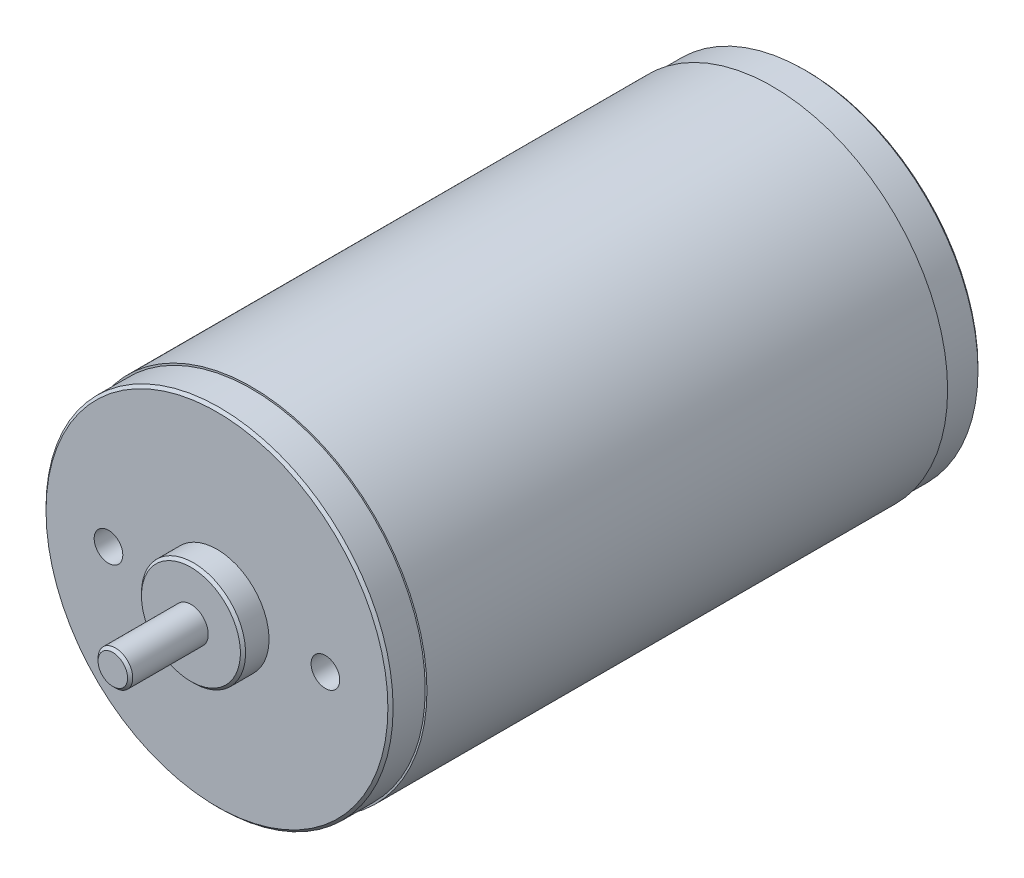
ISO-10303-21;
HEADER;
FILE_DESCRIPTION(('STEP AP214'),'2;1');
FILE_NAME('part.step','',(''),(''),'','','');
FILE_SCHEMA(('AUTOMOTIVE_DESIGN { 1 0 10303 214 1 1 1 1 }'));
ENDSEC;
DATA;
#1=APPLICATION_CONTEXT('core data for automotive mechanical design processes');
#2=APPLICATION_PROTOCOL_DEFINITION('international standard','automotive_design',2000,#1);
#3=PRODUCT_CONTEXT('',#1,'mechanical');
#4=PRODUCT('Part','Part','',(#3));
#5=PRODUCT_RELATED_PRODUCT_CATEGORY('part','',(#4));
#6=PRODUCT_DEFINITION_FORMATION('','',#4);
#7=PRODUCT_DEFINITION_CONTEXT('part definition',#1,'design');
#8=PRODUCT_DEFINITION('design','',#6,#7);
#9=PRODUCT_DEFINITION_SHAPE('','',#8);
#10=(LENGTH_UNIT() NAMED_UNIT(*) SI_UNIT(.MILLI.,.METRE.));
#11=(NAMED_UNIT(*) PLANE_ANGLE_UNIT() SI_UNIT($,.RADIAN.));
#12=(NAMED_UNIT(*) SI_UNIT($,.STERADIAN.) SOLID_ANGLE_UNIT());
#13=UNCERTAINTY_MEASURE_WITH_UNIT(LENGTH_MEASURE(1.E-05),#10,'distance_accuracy_value','');
#14=(GEOMETRIC_REPRESENTATION_CONTEXT(3) GLOBAL_UNCERTAINTY_ASSIGNED_CONTEXT((#13)) GLOBAL_UNIT_ASSIGNED_CONTEXT((#10,
#11,#12)) REPRESENTATION_CONTEXT('',''));
#15=CARTESIAN_POINT('',(0.,0.,0.));
#16=DIRECTION('',(0.,0.,1.));
#17=DIRECTION('',(1.,0.,0.));
#18=AXIS2_PLACEMENT_3D('',#15,#16,#17);
#19=CARTESIAN_POINT('',(0.,0.,12.));
#20=DIRECTION('',(0.,0.,1.));
#21=DIRECTION('',(1.,0.,0.));
#22=AXIS2_PLACEMENT_3D('',#19,#20,#21);
#23=PLANE('',#22);
#24=CARTESIAN_POINT('',(0.,0.,12.0000000000573));
#25=DIRECTION('',(0.,0.,-1.));
#26=DIRECTION('',(-1.,0.,0.));
#27=AXIS2_PLACEMENT_3D('',#24,#25,#26);
#28=CIRCLE('',#27,1.70000000002801);
#29=CARTESIAN_POINT('',(-1.70000000002801,0.,12.0000000000573));
#30=VERTEX_POINT('',#29);
#31=EDGE_CURVE('E19',#30,#30,#28,.T.);
#32=ORIENTED_EDGE('',*,*,#31,.F.);
#33=EDGE_LOOP('',(#32));
#34=FACE_BOUND('',#33,.T.);
#35=ADVANCED_FACE('F16',(#34),#23,.T.);
#36=CARTESIAN_POINT('',(0.,0.,11.7000000000758));
#37=DIRECTION('',(0.,0.,-1.));
#38=DIRECTION('',(-1.,0.,0.));
#39=AXIS2_PLACEMENT_3D('',#36,#37,#38);
#40=CONICAL_SURFACE('',#39,2.00000000000955,0.785398163397448);
#41=CARTESIAN_POINT('',(0.,0.,11.7));
#42=DIRECTION('',(0.,0.,-1.));
#43=DIRECTION('',(-1.,0.,0.));
#44=AXIS2_PLACEMENT_3D('',#41,#42,#43);
#45=CIRCLE('',#44,2.);
#46=CARTESIAN_POINT('',(-2.,0.,11.7));
#47=VERTEX_POINT('',#46);
#48=EDGE_CURVE('E61',#47,#47,#45,.T.);
#49=ORIENTED_EDGE('',*,*,#48,.F.);
#50=EDGE_LOOP('',(#49));
#51=FACE_BOUND('',#50,.T.);
#52=ORIENTED_EDGE('',*,*,#31,.T.);
#53=EDGE_LOOP('',(#52));
#54=FACE_BOUND('',#53,.T.);
#55=ADVANCED_FACE('F119',(#51,#54),#40,.T.);
#56=CARTESIAN_POINT('',(0.,0.,12.));
#57=DIRECTION('',(0.,0.,-1.));
#58=DIRECTION('',(-1.,0.,0.));
#59=AXIS2_PLACEMENT_3D('',#56,#57,#58);
#60=CYLINDRICAL_SURFACE('',#59,2.);
#61=CARTESIAN_POINT('',(0.,0.,3.));
#62=DIRECTION('',(0.,0.,-1.));
#63=DIRECTION('',(-1.,0.,0.));
#64=AXIS2_PLACEMENT_3D('',#61,#62,#63);
#65=CIRCLE('',#64,2.);
#66=CARTESIAN_POINT('',(-2.,0.,3.));
#67=VERTEX_POINT('',#66);
#68=EDGE_CURVE('E64',#67,#67,#65,.T.);
#69=ORIENTED_EDGE('',*,*,#68,.F.);
#70=EDGE_LOOP('',(#69));
#71=FACE_BOUND('',#70,.T.);
#72=ORIENTED_EDGE('',*,*,#48,.T.);
#73=EDGE_LOOP('',(#72));
#74=FACE_BOUND('',#73,.T.);
#75=ADVANCED_FACE('F115',(#71,#74),#60,.T.);
#76=CARTESIAN_POINT('',(0.,0.,-69.5));
#77=DIRECTION('',(0.,0.,-1.));
#78=DIRECTION('',(-1.,0.,0.));
#79=AXIS2_PLACEMENT_3D('',#76,#77,#78);
#80=PLANE('',#79);
#81=CARTESIAN_POINT('',(0.,0.,-69.5000000000618));
#82=DIRECTION('',(0.,0.,1.));
#83=DIRECTION('',(1.,0.,0.));
#84=AXIS2_PLACEMENT_3D('',#81,#82,#83);
#85=CIRCLE('',#84,6.02500000002237);
#86=CARTESIAN_POINT('',(6.02500000002237,0.,-69.5000000000618));
#87=VERTEX_POINT('',#86);
#88=EDGE_CURVE('E105',#87,#87,#85,.T.);
#89=ORIENTED_EDGE('',*,*,#88,.F.);
#90=EDGE_LOOP('',(#89));
#91=FACE_BOUND('',#90,.T.);
#92=ADVANCED_FACE('F118',(#91),#80,.T.);
#93=CARTESIAN_POINT('',(0.,0.,3.));
#94=DIRECTION('',(0.,0.,1.));
#95=DIRECTION('',(1.,0.,0.));
#96=AXIS2_PLACEMENT_3D('',#93,#94,#95);
#97=PLANE('',#96);
#98=ORIENTED_EDGE('',*,*,#68,.T.);
#99=EDGE_LOOP('',(#98));
#100=FACE_BOUND('',#99,.T.);
#101=CARTESIAN_POINT('',(0.,0.,2.9999999999859));
#102=DIRECTION('',(0.,0.,-1.));
#103=DIRECTION('',(-1.,0.,0.));
#104=AXIS2_PLACEMENT_3D('',#101,#102,#103);
#105=CIRCLE('',#104,5.70000000004711);
#106=CARTESIAN_POINT('',(-5.70000000004711,0.,2.9999999999859));
#107=VERTEX_POINT('',#106);
#108=EDGE_CURVE('E57',#107,#107,#105,.T.);
#109=ORIENTED_EDGE('',*,*,#108,.F.);
#110=EDGE_LOOP('',(#109));
#111=FACE_BOUND('',#110,.T.);
#112=ADVANCED_FACE('F112',(#100,#111),#97,.T.);
#113=CARTESIAN_POINT('',(0.,0.,-69.2000000000803));
#114=DIRECTION('',(0.,0.,1.));
#115=DIRECTION('',(1.,0.,0.));
#116=AXIS2_PLACEMENT_3D('',#113,#114,#115);
#117=CONICAL_SURFACE('',#116,6.32500000000391,0.785398163397448);
#118=ORIENTED_EDGE('',*,*,#88,.T.);
#119=EDGE_LOOP('',(#118));
#120=FACE_BOUND('',#119,.T.);
#121=CARTESIAN_POINT('',(0.,0.,-69.2));
#122=DIRECTION('',(0.,0.,1.));
#123=DIRECTION('',(1.,0.,0.));
#124=AXIS2_PLACEMENT_3D('',#121,#122,#123);
#125=CIRCLE('',#124,6.325);
#126=CARTESIAN_POINT('',(6.325,0.,-69.2));
#127=VERTEX_POINT('',#126);
#128=EDGE_CURVE('E47',#127,#127,#125,.T.);
#129=ORIENTED_EDGE('',*,*,#128,.F.);
#130=EDGE_LOOP('',(#129));
#131=FACE_BOUND('',#130,.T.);
#132=ADVANCED_FACE('F39',(#120,#131),#117,.T.);
#133=CARTESIAN_POINT('',(-12.5,0.,-8.10000000012678));
#134=DIRECTION('',(0.,0.,1.));
#135=DIRECTION('',(1.,0.,0.));
#136=AXIS2_PLACEMENT_3D('',#133,#134,#135);
#137=CONICAL_SURFACE('',#136,1.6499999998814,1.02974425849465);
#138=CARTESIAN_POINT('',(-12.5000000002728,0.,-9.09142002154795));
#139=VERTEX_POINT('',#138);
#140=VERTEX_LOOP('',#139);
#141=FACE_BOUND('',#140,.T.);
#142=CARTESIAN_POINT('',(-12.5,0.,-8.1));
#143=DIRECTION('',(0.,0.,1.));
#144=DIRECTION('',(1.,0.,0.));
#145=AXIS2_PLACEMENT_3D('',#142,#143,#144);
#146=CIRCLE('',#145,1.65);
#147=CARTESIAN_POINT('',(-10.85,0.,-8.1));
#148=VERTEX_POINT('',#147);
#149=EDGE_CURVE('E43',#148,#148,#146,.T.);
#150=ORIENTED_EDGE('',*,*,#149,.T.);
#151=EDGE_LOOP('',(#150));
#152=FACE_BOUND('',#151,.T.);
#153=ADVANCED_FACE('F35',(#141,#152),#137,.F.);
#154=CARTESIAN_POINT('',(12.5,0.,-8.10000000012678));
#155=DIRECTION('',(0.,0.,1.));
#156=DIRECTION('',(1.,0.,0.));
#157=AXIS2_PLACEMENT_3D('',#154,#155,#156);
#158=CONICAL_SURFACE('',#157,1.64999999985866,1.02974425848248);
#159=CARTESIAN_POINT('',(12.4999999997328,0.,-9.09142002157637));
#160=VERTEX_POINT('',#159);
#161=VERTEX_LOOP('',#160);
#162=FACE_BOUND('',#161,.T.);
#163=CARTESIAN_POINT('',(12.5,0.,-8.1));
#164=DIRECTION('',(0.,0.,1.));
#165=DIRECTION('',(1.,0.,0.));
#166=AXIS2_PLACEMENT_3D('',#163,#164,#165);
#167=CIRCLE('',#166,1.65);
#168=CARTESIAN_POINT('',(14.15,0.,-8.1));
#169=VERTEX_POINT('',#168);
#170=EDGE_CURVE('E46',#169,#169,#167,.T.);
#171=ORIENTED_EDGE('',*,*,#170,.T.);
#172=EDGE_LOOP('',(#171));
#173=FACE_BOUND('',#172,.T.);
#174=ADVANCED_FACE('F38',(#162,#173),#158,.F.);
#175=CARTESIAN_POINT('',(0.,0.,2.70000000000437));
#176=DIRECTION('',(0.,0.,-1.));
#177=DIRECTION('',(-1.,0.,0.));
#178=AXIS2_PLACEMENT_3D('',#175,#176,#177);
#179=CONICAL_SURFACE('',#178,6.00000000002865,0.785398163397448);
#180=CARTESIAN_POINT('',(0.,0.,2.70000000000002));
#181=DIRECTION('',(0.,0.,-1.));
#182=DIRECTION('',(-1.,0.,0.));
#183=AXIS2_PLACEMENT_3D('',#180,#181,#182);
#184=CIRCLE('',#183,6.);
#185=CARTESIAN_POINT('',(-6.,0.,2.70000000000002));
#186=VERTEX_POINT('',#185);
#187=EDGE_CURVE('E53',#186,#186,#184,.T.);
#188=ORIENTED_EDGE('',*,*,#187,.F.);
#189=EDGE_LOOP('',(#188));
#190=FACE_BOUND('',#189,.T.);
#191=ORIENTED_EDGE('',*,*,#108,.T.);
#192=EDGE_LOOP('',(#191));
#193=FACE_BOUND('',#192,.T.);
#194=ADVANCED_FACE('F260',(#190,#193),#179,.T.);
#195=CARTESIAN_POINT('',(0.,0.,-69.5));
#196=DIRECTION('',(0.,0.,1.));
#197=DIRECTION('',(1.,0.,0.));
#198=AXIS2_PLACEMENT_3D('',#195,#196,#197);
#199=CYLINDRICAL_SURFACE('',#198,6.325);
#200=ORIENTED_EDGE('',*,*,#128,.T.);
#201=EDGE_LOOP('',(#200));
#202=FACE_BOUND('',#201,.T.);
#203=CARTESIAN_POINT('',(0.,0.,-68.));
#204=DIRECTION('',(0.,0.,1.));
#205=DIRECTION('',(1.,0.,0.));
#206=AXIS2_PLACEMENT_3D('',#203,#204,#205);
#207=CIRCLE('',#206,6.325);
#208=CARTESIAN_POINT('',(6.325,0.,-68.));
#209=VERTEX_POINT('',#208);
#210=EDGE_CURVE('E99',#209,#209,#207,.F.);
#211=ORIENTED_EDGE('',*,*,#210,.T.);
#212=EDGE_LOOP('',(#211));
#213=FACE_BOUND('',#212,.T.);
#214=ADVANCED_FACE('F267',(#202,#213),#199,.T.);
#215=CARTESIAN_POINT('',(-12.5,0.,0.));
#216=DIRECTION('',(0.,0.,1.));
#217=DIRECTION('',(1.,0.,0.));
#218=AXIS2_PLACEMENT_3D('',#215,#216,#217);
#219=CYLINDRICAL_SURFACE('',#218,1.65);
#220=CARTESIAN_POINT('',(-12.5,0.,0.));
#221=DIRECTION('',(0.,0.,1.));
#222=DIRECTION('',(1.,0.,0.));
#223=AXIS2_PLACEMENT_3D('',#220,#221,#222);
#224=CIRCLE('',#223,1.65);
#225=CARTESIAN_POINT('',(-10.85,0.,0.));
#226=VERTEX_POINT('',#225);
#227=EDGE_CURVE('E95',#226,#226,#224,.F.);
#228=ORIENTED_EDGE('',*,*,#227,.F.);
#229=EDGE_LOOP('',(#228));
#230=FACE_BOUND('',#229,.T.);
#231=ORIENTED_EDGE('',*,*,#149,.F.);
#232=EDGE_LOOP('',(#231));
#233=FACE_BOUND('',#232,.T.);
#234=ADVANCED_FACE('F275',(#230,#233),#219,.F.);
#235=CARTESIAN_POINT('',(12.5,0.,0.));
#236=DIRECTION('',(0.,0.,1.));
#237=DIRECTION('',(1.,0.,0.));
#238=AXIS2_PLACEMENT_3D('',#235,#236,#237);
#239=CYLINDRICAL_SURFACE('',#238,1.65);
#240=CARTESIAN_POINT('',(12.5,0.,0.));
#241=DIRECTION('',(0.,0.,1.));
#242=DIRECTION('',(1.,0.,0.));
#243=AXIS2_PLACEMENT_3D('',#240,#241,#242);
#244=CIRCLE('',#243,1.65);
#245=CARTESIAN_POINT('',(14.15,0.,0.));
#246=VERTEX_POINT('',#245);
#247=EDGE_CURVE('E91',#246,#246,#244,.F.);
#248=ORIENTED_EDGE('',*,*,#247,.F.);
#249=EDGE_LOOP('',(#248));
#250=FACE_BOUND('',#249,.T.);
#251=ORIENTED_EDGE('',*,*,#170,.F.);
#252=EDGE_LOOP('',(#251));
#253=FACE_BOUND('',#252,.T.);
#254=ADVANCED_FACE('F283',(#250,#253),#239,.F.);
#255=CARTESIAN_POINT('',(0.,0.,3.));
#256=DIRECTION('',(0.,0.,-1.));
#257=DIRECTION('',(-1.,0.,0.));
#258=AXIS2_PLACEMENT_3D('',#255,#256,#257);
#259=CYLINDRICAL_SURFACE('',#258,6.);
#260=CARTESIAN_POINT('',(0.,0.,0.));
#261=DIRECTION('',(0.,0.,-1.));
#262=DIRECTION('',(-1.,0.,0.));
#263=AXIS2_PLACEMENT_3D('',#260,#261,#262);
#264=CIRCLE('',#263,6.);
#265=CARTESIAN_POINT('',(-6.,0.,0.));
#266=VERTEX_POINT('',#265);
#267=EDGE_CURVE('E87',#266,#266,#264,.T.);
#268=ORIENTED_EDGE('',*,*,#267,.F.);
#269=EDGE_LOOP('',(#268));
#270=FACE_BOUND('',#269,.T.);
#271=ORIENTED_EDGE('',*,*,#187,.T.);
#272=EDGE_LOOP('',(#271));
#273=FACE_BOUND('',#272,.T.);
#274=ADVANCED_FACE('F291',(#270,#273),#259,.T.);
#275=CARTESIAN_POINT('',(0.,0.,-68.));
#276=DIRECTION('',(0.,0.,1.));
#277=DIRECTION('',(1.,0.,0.));
#278=AXIS2_PLACEMENT_3D('',#275,#276,#277);
#279=PLANE('',#278);
#280=ORIENTED_EDGE('',*,*,#210,.F.);
#281=EDGE_LOOP('',(#280));
#282=FACE_BOUND('',#281,.T.);
#283=CARTESIAN_POINT('',(0.,0.,-68.));
#284=DIRECTION('',(0.,0.,1.));
#285=DIRECTION('',(1.,0.,0.));
#286=AXIS2_PLACEMENT_3D('',#283,#284,#285);
#287=CIRCLE('',#286,19.7);
#288=CARTESIAN_POINT('',(19.7,0.,-68.));
#289=VERTEX_POINT('',#288);
#290=EDGE_CURVE('E83',#289,#289,#287,.T.);
#291=ORIENTED_EDGE('',*,*,#290,.F.);
#292=EDGE_LOOP('',(#291));
#293=FACE_BOUND('',#292,.T.);
#294=ADVANCED_FACE('F157',(#282,#293),#279,.F.);
#295=CARTESIAN_POINT('',(0.,0.,0.));
#296=DIRECTION('',(0.,0.,1.));
#297=DIRECTION('',(1.,0.,0.));
#298=AXIS2_PLACEMENT_3D('',#295,#296,#297);
#299=PLANE('',#298);
#300=ORIENTED_EDGE('',*,*,#267,.T.);
#301=EDGE_LOOP('',(#300));
#302=FACE_BOUND('',#301,.T.);
#303=ORIENTED_EDGE('',*,*,#247,.T.);
#304=EDGE_LOOP('',(#303));
#305=FACE_BOUND('',#304,.T.);
#306=ORIENTED_EDGE('',*,*,#227,.T.);
#307=EDGE_LOOP('',(#306));
#308=FACE_BOUND('',#307,.T.);
#309=CARTESIAN_POINT('',(0.,0.,0.));
#310=DIRECTION('',(0.,0.,-1.));
#311=DIRECTION('',(-1.,0.,0.));
#312=AXIS2_PLACEMENT_3D('',#309,#310,#311);
#313=CIRCLE('',#312,19.7);
#314=CARTESIAN_POINT('',(-19.7,0.,0.));
#315=VERTEX_POINT('',#314);
#316=EDGE_CURVE('E78',#315,#315,#313,.T.);
#317=ORIENTED_EDGE('',*,*,#316,.F.);
#318=EDGE_LOOP('',(#317));
#319=FACE_BOUND('',#318,.T.);
#320=ADVANCED_FACE('F146',(#302,#305,#308,#319),#299,.T.);
#321=CARTESIAN_POINT('',(0.,0.,-67.7));
#322=DIRECTION('',(0.,0.,1.));
#323=DIRECTION('',(1.,0.,0.));
#324=AXIS2_PLACEMENT_3D('',#321,#322,#323);
#325=CONICAL_SURFACE('',#324,20.,0.785398163397466);
#326=ORIENTED_EDGE('',*,*,#290,.T.);
#327=EDGE_LOOP('',(#326));
#328=FACE_BOUND('',#327,.T.);
#329=CARTESIAN_POINT('',(0.,0.,-67.7));
#330=DIRECTION('',(0.,0.,-1.));
#331=DIRECTION('',(-1.,0.,0.));
#332=AXIS2_PLACEMENT_3D('',#329,#330,#331);
#333=CIRCLE('',#332,20.);
#334=CARTESIAN_POINT('',(-20.,0.,-67.7));
#335=VERTEX_POINT('',#334);
#336=EDGE_CURVE('E82',#335,#335,#333,.F.);
#337=ORIENTED_EDGE('',*,*,#336,.F.);
#338=EDGE_LOOP('',(#337));
#339=FACE_BOUND('',#338,.T.);
#340=ADVANCED_FACE('F143',(#328,#339),#325,.T.);
#341=CARTESIAN_POINT('',(0.,0.,-0.299999999999963));
#342=DIRECTION('',(0.,0.,-1.));
#343=DIRECTION('',(-1.,0.,0.));
#344=AXIS2_PLACEMENT_3D('',#341,#342,#343);
#345=CONICAL_SURFACE('',#344,20.,0.785398163397472);
#346=ORIENTED_EDGE('',*,*,#316,.T.);
#347=EDGE_LOOP('',(#346));
#348=FACE_BOUND('',#347,.T.);
#349=CARTESIAN_POINT('',(0.,0.,-0.299999999999964));
#350=DIRECTION('',(0.,0.,1.));
#351=DIRECTION('',(1.,0.,0.));
#352=AXIS2_PLACEMENT_3D('',#349,#350,#351);
#353=CIRCLE('',#352,20.);
#354=CARTESIAN_POINT('',(20.,0.,-0.299999999999964));
#355=VERTEX_POINT('',#354);
#356=EDGE_CURVE('E77',#355,#355,#353,.F.);
#357=ORIENTED_EDGE('',*,*,#356,.F.);
#358=EDGE_LOOP('',(#357));
#359=FACE_BOUND('',#358,.T.);
#360=ADVANCED_FACE('F145',(#348,#359),#345,.T.);
#361=CARTESIAN_POINT('',(0.,0.,-64.));
#362=DIRECTION('',(0.,0.,-1.));
#363=DIRECTION('',(-1.,0.,0.));
#364=AXIS2_PLACEMENT_3D('',#361,#362,#363);
#365=CYLINDRICAL_SURFACE('',#364,20.);
#366=CARTESIAN_POINT('',(0.,0.,-64.));
#367=DIRECTION('',(0.,0.,-1.));
#368=DIRECTION('',(-1.,0.,0.));
#369=AXIS2_PLACEMENT_3D('',#366,#367,#368);
#370=CIRCLE('',#369,20.);
#371=CARTESIAN_POINT('',(-20.,0.,-64.));
#372=VERTEX_POINT('',#371);
#373=EDGE_CURVE('E73',#372,#372,#370,.F.);
#374=ORIENTED_EDGE('',*,*,#373,.F.);
#375=EDGE_LOOP('',(#374));
#376=FACE_BOUND('',#375,.T.);
#377=ORIENTED_EDGE('',*,*,#336,.T.);
#378=EDGE_LOOP('',(#377));
#379=FACE_BOUND('',#378,.T.);
#380=ADVANCED_FACE('F141',(#376,#379),#365,.T.);
#381=CARTESIAN_POINT('',(0.,0.,-4.));
#382=DIRECTION('',(0.,0.,1.));
#383=DIRECTION('',(1.,0.,0.));
#384=AXIS2_PLACEMENT_3D('',#381,#382,#383);
#385=CYLINDRICAL_SURFACE('',#384,20.);
#386=CARTESIAN_POINT('',(0.,0.,-4.));
#387=DIRECTION('',(0.,0.,1.));
#388=DIRECTION('',(1.,0.,0.));
#389=AXIS2_PLACEMENT_3D('',#386,#387,#388);
#390=CIRCLE('',#389,20.);
#391=CARTESIAN_POINT('',(20.,0.,-4.));
#392=VERTEX_POINT('',#391);
#393=EDGE_CURVE('E69',#392,#392,#390,.F.);
#394=ORIENTED_EDGE('',*,*,#393,.F.);
#395=EDGE_LOOP('',(#394));
#396=FACE_BOUND('',#395,.T.);
#397=ORIENTED_EDGE('',*,*,#356,.T.);
#398=EDGE_LOOP('',(#397));
#399=FACE_BOUND('',#398,.T.);
#400=ADVANCED_FACE('F176',(#396,#399),#385,.T.);
#401=CARTESIAN_POINT('',(0.,0.,-64.));
#402=DIRECTION('',(0.,0.,-1.));
#403=DIRECTION('',(-1.,0.,0.));
#404=AXIS2_PLACEMENT_3D('',#401,#402,#403);
#405=PLANE('',#404);
#406=CARTESIAN_POINT('',(0.,0.,-64.));
#407=DIRECTION('',(0.,0.,1.));
#408=DIRECTION('',(1.,0.,0.));
#409=AXIS2_PLACEMENT_3D('',#406,#407,#408);
#410=CIRCLE('',#409,20.2);
#411=CARTESIAN_POINT('',(20.2,0.,-64.));
#412=VERTEX_POINT('',#411);
#413=EDGE_CURVE('E26',#412,#412,#410,.T.);
#414=ORIENTED_EDGE('',*,*,#413,.F.);
#415=EDGE_LOOP('',(#414));
#416=FACE_BOUND('',#415,.T.);
#417=ORIENTED_EDGE('',*,*,#373,.T.);
#418=EDGE_LOOP('',(#417));
#419=FACE_BOUND('',#418,.T.);
#420=ADVANCED_FACE('F169',(#416,#419),#405,.T.);
#421=CARTESIAN_POINT('',(0.,0.,-4.));
#422=DIRECTION('',(0.,0.,1.));
#423=DIRECTION('',(1.,0.,0.));
#424=AXIS2_PLACEMENT_3D('',#421,#422,#423);
#425=PLANE('',#424);
#426=CARTESIAN_POINT('',(0.,0.,-4.));
#427=DIRECTION('',(0.,0.,1.));
#428=DIRECTION('',(1.,0.,0.));
#429=AXIS2_PLACEMENT_3D('',#426,#427,#428);
#430=CIRCLE('',#429,20.2);
#431=CARTESIAN_POINT('',(20.2,0.,-4.));
#432=VERTEX_POINT('',#431);
#433=EDGE_CURVE('E11',#432,#432,#430,.F.);
#434=ORIENTED_EDGE('',*,*,#433,.F.);
#435=EDGE_LOOP('',(#434));
#436=FACE_BOUND('',#435,.T.);
#437=ORIENTED_EDGE('',*,*,#393,.T.);
#438=EDGE_LOOP('',(#437));
#439=FACE_BOUND('',#438,.T.);
#440=ADVANCED_FACE('F162',(#436,#439),#425,.T.);
#441=CARTESIAN_POINT('',(0.,0.,-68.));
#442=DIRECTION('',(0.,0.,1.));
#443=DIRECTION('',(1.,0.,0.));
#444=AXIS2_PLACEMENT_3D('',#441,#442,#443);
#445=CYLINDRICAL_SURFACE('',#444,20.2);
#446=ORIENTED_EDGE('',*,*,#433,.T.);
#447=EDGE_LOOP('',(#446));
#448=FACE_BOUND('',#447,.T.);
#449=ORIENTED_EDGE('',*,*,#413,.T.);
#450=EDGE_LOOP('',(#449));
#451=FACE_BOUND('',#450,.T.);
#452=ADVANCED_FACE('F160',(#448,#451),#445,.T.);
#453=CLOSED_SHELL('',(#35,#55,#75,#92,#112,#132,#153,#174,#194,#214,#234,#254,#274,#294,#320,
#340,#360,#380,#400,#420,#440,#452));
#454=MANIFOLD_SOLID_BREP('B1',#453);
#455=ADVANCED_BREP_SHAPE_REPRESENTATION('',(#18,#454),#14);
#456=SHAPE_DEFINITION_REPRESENTATION(#9,#455);
ENDSEC;
END-ISO-10303-21;
